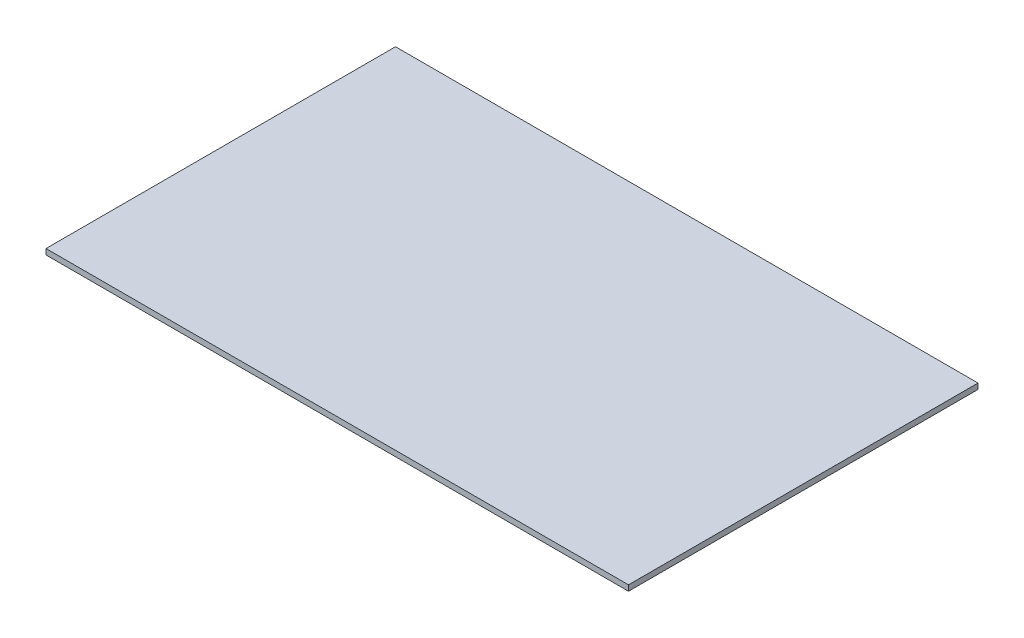
ISO-10303-21;
HEADER;
FILE_DESCRIPTION(('STEP AP214'),'2;1');
FILE_NAME('part.step','',(''),(''),'','','');
FILE_SCHEMA(('AUTOMOTIVE_DESIGN { 1 0 10303 214 1 1 1 1 }'));
ENDSEC;
DATA;
#1=APPLICATION_CONTEXT('core data for automotive mechanical design processes');
#2=APPLICATION_PROTOCOL_DEFINITION('international standard','automotive_design',2000,#1);
#3=PRODUCT_CONTEXT('',#1,'mechanical');
#4=PRODUCT('Part','Part','',(#3));
#5=PRODUCT_RELATED_PRODUCT_CATEGORY('part','',(#4));
#6=PRODUCT_DEFINITION_FORMATION('','',#4);
#7=PRODUCT_DEFINITION_CONTEXT('part definition',#1,'design');
#8=PRODUCT_DEFINITION('design','',#6,#7);
#9=PRODUCT_DEFINITION_SHAPE('','',#8);
#10=(LENGTH_UNIT() NAMED_UNIT(*) SI_UNIT(.MILLI.,.METRE.));
#11=(NAMED_UNIT(*) PLANE_ANGLE_UNIT() SI_UNIT($,.RADIAN.));
#12=(NAMED_UNIT(*) SI_UNIT($,.STERADIAN.) SOLID_ANGLE_UNIT());
#13=UNCERTAINTY_MEASURE_WITH_UNIT(LENGTH_MEASURE(1.E-05),#10,'distance_accuracy_value','');
#14=(GEOMETRIC_REPRESENTATION_CONTEXT(3) GLOBAL_UNCERTAINTY_ASSIGNED_CONTEXT((#13)) GLOBAL_UNIT_ASSIGNED_CONTEXT((#10,
#11,#12)) REPRESENTATION_CONTEXT('',''));
#15=CARTESIAN_POINT('',(0.,0.,0.));
#16=DIRECTION('',(0.,0.,1.));
#17=DIRECTION('',(1.,0.,0.));
#18=AXIS2_PLACEMENT_3D('',#15,#16,#17);
#19=CARTESIAN_POINT('',(-62.5,1.2,37.5));
#20=DIRECTION('',(1.,0.,0.));
#21=DIRECTION('',(0.,0.,-1.));
#22=AXIS2_PLACEMENT_3D('',#19,#20,#21);
#23=PLANE('',#22);
#24=DIRECTION('',(0.,0.,1.));
#25=VECTOR('',#24,1.);
#26=CARTESIAN_POINT('',(-62.5,0.,37.5));
#27=LINE('',#26,#25);
#28=CARTESIAN_POINT('',(-62.5,0.,-37.5));
#29=VERTEX_POINT('',#28);
#30=CARTESIAN_POINT('',(-62.5,0.,37.5));
#31=VERTEX_POINT('',#30);
#32=EDGE_CURVE('E97',#29,#31,#27,.T.);
#33=ORIENTED_EDGE('',*,*,#32,.T.);
#34=DIRECTION('',(0.,-1.,0.));
#35=VECTOR('',#34,1.);
#36=CARTESIAN_POINT('',(-62.5,1.2,37.5));
#37=LINE('',#36,#35);
#38=CARTESIAN_POINT('',(-62.5,1.2,37.5));
#39=VERTEX_POINT('',#38);
#40=EDGE_CURVE('E11',#39,#31,#37,.T.);
#41=ORIENTED_EDGE('',*,*,#40,.F.);
#42=DIRECTION('',(0.,0.,1.));
#43=VECTOR('',#42,1.);
#44=CARTESIAN_POINT('',(-62.5,1.2,37.5));
#45=LINE('',#44,#43);
#46=CARTESIAN_POINT('',(-62.5,1.2,-37.5));
#47=VERTEX_POINT('',#46);
#48=EDGE_CURVE('E85',#47,#39,#45,.T.);
#49=ORIENTED_EDGE('',*,*,#48,.F.);
#50=DIRECTION('',(0.,-1.,0.));
#51=VECTOR('',#50,1.);
#52=CARTESIAN_POINT('',(-62.5,1.2,-37.5));
#53=LINE('',#52,#51);
#54=EDGE_CURVE('E93',#47,#29,#53,.T.);
#55=ORIENTED_EDGE('',*,*,#54,.T.);
#56=EDGE_LOOP('',(#33,#41,#49,#55));
#57=FACE_BOUND('',#56,.T.);
#58=ADVANCED_FACE('F34',(#57),#23,.F.);
#59=CARTESIAN_POINT('',(62.5,1.2,37.5));
#60=DIRECTION('',(0.,0.,-1.));
#61=DIRECTION('',(-1.,0.,0.));
#62=AXIS2_PLACEMENT_3D('',#59,#60,#61);
#63=PLANE('',#62);
#64=DIRECTION('',(1.,0.,0.));
#65=VECTOR('',#64,1.);
#66=CARTESIAN_POINT('',(62.5,0.,37.5));
#67=LINE('',#66,#65);
#68=CARTESIAN_POINT('',(62.5,0.,37.5));
#69=VERTEX_POINT('',#68);
#70=EDGE_CURVE('E89',#31,#69,#67,.T.);
#71=ORIENTED_EDGE('',*,*,#70,.T.);
#72=DIRECTION('',(0.,-1.,0.));
#73=VECTOR('',#72,1.);
#74=CARTESIAN_POINT('',(62.5,1.2,37.5));
#75=LINE('',#74,#73);
#76=CARTESIAN_POINT('',(62.5,1.2,37.5));
#77=VERTEX_POINT('',#76);
#78=EDGE_CURVE('E42',#77,#69,#75,.T.);
#79=ORIENTED_EDGE('',*,*,#78,.F.);
#80=DIRECTION('',(1.,0.,0.));
#81=VECTOR('',#80,1.);
#82=CARTESIAN_POINT('',(62.5,1.2,37.5));
#83=LINE('',#82,#81);
#84=EDGE_CURVE('E80',#39,#77,#83,.T.);
#85=ORIENTED_EDGE('',*,*,#84,.F.);
#86=ORIENTED_EDGE('',*,*,#40,.T.);
#87=EDGE_LOOP('',(#71,#79,#85,#86));
#88=FACE_BOUND('',#87,.T.);
#89=ADVANCED_FACE('F88',(#88),#63,.F.);
#90=CARTESIAN_POINT('',(62.5,1.2,37.5));
#91=DIRECTION('',(-1.,0.,0.));
#92=DIRECTION('',(0.,0.,1.));
#93=AXIS2_PLACEMENT_3D('',#90,#91,#92);
#94=PLANE('',#93);
#95=DIRECTION('',(0.,0.,-1.));
#96=VECTOR('',#95,1.);
#97=CARTESIAN_POINT('',(62.5,0.,37.5));
#98=LINE('',#97,#96);
#99=CARTESIAN_POINT('',(62.5,0.,-37.5));
#100=VERTEX_POINT('',#99);
#101=EDGE_CURVE('E67',#69,#100,#98,.T.);
#102=ORIENTED_EDGE('',*,*,#101,.T.);
#103=DIRECTION('',(0.,-1.,0.));
#104=VECTOR('',#103,1.);
#105=CARTESIAN_POINT('',(62.5,1.2,-37.5));
#106=LINE('',#105,#104);
#107=CARTESIAN_POINT('',(62.5,1.2,-37.5));
#108=VERTEX_POINT('',#107);
#109=EDGE_CURVE('E90',#108,#100,#106,.T.);
#110=ORIENTED_EDGE('',*,*,#109,.F.);
#111=DIRECTION('',(0.,0.,-1.));
#112=VECTOR('',#111,1.);
#113=CARTESIAN_POINT('',(62.5,1.2,37.5));
#114=LINE('',#113,#112);
#115=EDGE_CURVE('E83',#77,#108,#114,.T.);
#116=ORIENTED_EDGE('',*,*,#115,.F.);
#117=ORIENTED_EDGE('',*,*,#78,.T.);
#118=EDGE_LOOP('',(#102,#110,#116,#117));
#119=FACE_BOUND('',#118,.T.);
#120=ADVANCED_FACE('F91',(#119),#94,.F.);
#121=CARTESIAN_POINT('',(62.5,1.2,-37.5));
#122=DIRECTION('',(0.,0.,1.));
#123=DIRECTION('',(1.,0.,0.));
#124=AXIS2_PLACEMENT_3D('',#121,#122,#123);
#125=PLANE('',#124);
#126=DIRECTION('',(-1.,0.,0.));
#127=VECTOR('',#126,1.);
#128=CARTESIAN_POINT('',(62.5,0.,-37.5));
#129=LINE('',#128,#127);
#130=EDGE_CURVE('E73',#100,#29,#129,.T.);
#131=ORIENTED_EDGE('',*,*,#130,.T.);
#132=ORIENTED_EDGE('',*,*,#54,.F.);
#133=DIRECTION('',(-1.,0.,0.));
#134=VECTOR('',#133,1.);
#135=CARTESIAN_POINT('',(62.5,1.2,-37.5));
#136=LINE('',#135,#134);
#137=EDGE_CURVE('E50',#108,#47,#136,.T.);
#138=ORIENTED_EDGE('',*,*,#137,.F.);
#139=ORIENTED_EDGE('',*,*,#109,.T.);
#140=EDGE_LOOP('',(#131,#132,#138,#139));
#141=FACE_BOUND('',#140,.T.);
#142=ADVANCED_FACE('F104',(#141),#125,.F.);
#143=CARTESIAN_POINT('',(0.,1.2,0.));
#144=DIRECTION('',(0.,1.,0.));
#145=DIRECTION('',(0.,0.,1.));
#146=AXIS2_PLACEMENT_3D('',#143,#144,#145);
#147=PLANE('',#146);
#148=ORIENTED_EDGE('',*,*,#48,.T.);
#149=ORIENTED_EDGE('',*,*,#84,.T.);
#150=ORIENTED_EDGE('',*,*,#115,.T.);
#151=ORIENTED_EDGE('',*,*,#137,.T.);
#152=EDGE_LOOP('',(#148,#149,#150,#151));
#153=FACE_BOUND('',#152,.T.);
#154=ADVANCED_FACE('F81',(#153),#147,.T.);
#155=CARTESIAN_POINT('',(0.,0.,0.));
#156=DIRECTION('',(0.,1.,0.));
#157=DIRECTION('',(0.,0.,1.));
#158=AXIS2_PLACEMENT_3D('',#155,#156,#157);
#159=PLANE('',#158);
#160=ORIENTED_EDGE('',*,*,#32,.F.);
#161=ORIENTED_EDGE('',*,*,#130,.F.);
#162=ORIENTED_EDGE('',*,*,#101,.F.);
#163=ORIENTED_EDGE('',*,*,#70,.F.);
#164=EDGE_LOOP('',(#160,#161,#162,#163));
#165=FACE_BOUND('',#164,.T.);
#166=ADVANCED_FACE('F107',(#165),#159,.F.);
#167=CLOSED_SHELL('',(#58,#89,#120,#142,#154,#166));
#168=MANIFOLD_SOLID_BREP('B2',#167);
#169=ADVANCED_BREP_SHAPE_REPRESENTATION('',(#18,#168),#14);
#170=SHAPE_DEFINITION_REPRESENTATION(#9,#169);
ENDSEC;
END-ISO-10303-21;
